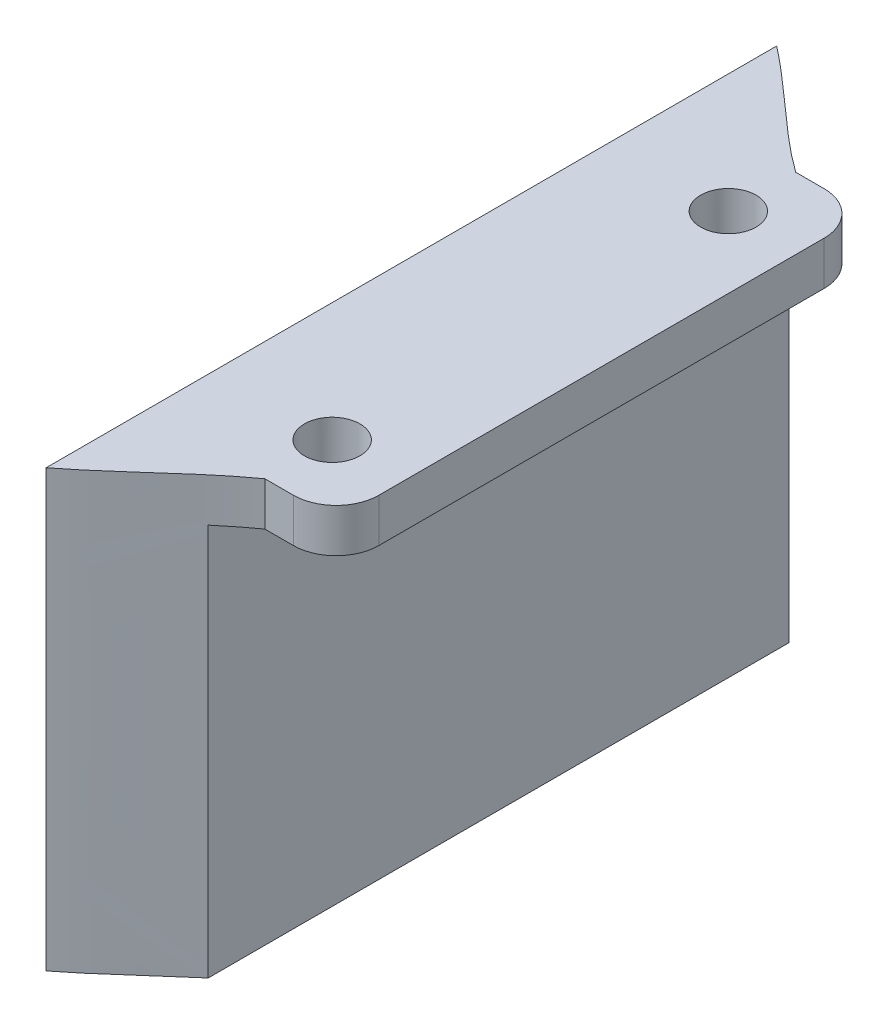
ISO-10303-21;
HEADER;
FILE_DESCRIPTION(('STEP AP214'),'2;1');
FILE_NAME('part.step','',(''),(''),'','','');
FILE_SCHEMA(('AUTOMOTIVE_DESIGN { 1 0 10303 214 1 1 1 1 }'));
ENDSEC;
DATA;
#1=APPLICATION_CONTEXT('core data for automotive mechanical design processes');
#2=APPLICATION_PROTOCOL_DEFINITION('international standard','automotive_design',2000,#1);
#3=PRODUCT_CONTEXT('',#1,'mechanical');
#4=PRODUCT('Part','Part','',(#3));
#5=PRODUCT_RELATED_PRODUCT_CATEGORY('part','',(#4));
#6=PRODUCT_DEFINITION_FORMATION('','',#4);
#7=PRODUCT_DEFINITION_CONTEXT('part definition',#1,'design');
#8=PRODUCT_DEFINITION('design','',#6,#7);
#9=PRODUCT_DEFINITION_SHAPE('','',#8);
#10=(LENGTH_UNIT() NAMED_UNIT(*) SI_UNIT(.MILLI.,.METRE.));
#11=(NAMED_UNIT(*) PLANE_ANGLE_UNIT() SI_UNIT($,.RADIAN.));
#12=(NAMED_UNIT(*) SI_UNIT($,.STERADIAN.) SOLID_ANGLE_UNIT());
#13=UNCERTAINTY_MEASURE_WITH_UNIT(LENGTH_MEASURE(1.E-05),#10,'distance_accuracy_value','');
#14=(GEOMETRIC_REPRESENTATION_CONTEXT(3) GLOBAL_UNCERTAINTY_ASSIGNED_CONTEXT((#13)) GLOBAL_UNIT_ASSIGNED_CONTEXT((#10,
#11,#12)) REPRESENTATION_CONTEXT('',''));
#15=CARTESIAN_POINT('',(0.,0.,0.));
#16=DIRECTION('',(0.,0.,1.));
#17=DIRECTION('',(1.,0.,0.));
#18=AXIS2_PLACEMENT_3D('',#15,#16,#17);
#19=CARTESIAN_POINT('',(138.702606635071,-5.5,42.5271998288506));
#20=DIRECTION('',(0.,1.,0.));
#21=DIRECTION('',(0.,0.,1.));
#22=AXIS2_PLACEMENT_3D('',#19,#20,#21);
#23=PLANE('',#22);
#24=CARTESIAN_POINT('',(142.702606635071,-5.5,-29.0568720379147));
#25=CARTESIAN_POINT('',(133.287763268237,-5.5,-35.7757587441815));
#26=CARTESIAN_POINT('',(125.082628435847,-5.5,-47.1414686898549));
#27=CARTESIAN_POINT('',(112.637979465165,-5.5,-48.4568720379147));
#28=B_SPLINE_CURVE_WITH_KNOTS('',3,(#24,#25,#26,#27),.UNSPECIFIED.,.F.,.F.,(4,4),(0.,1.),.UNSPECIFIED.);
#29=CARTESIAN_POINT('',(138.702606635071,-5.5,-32.1976654202298));
#30=VERTEX_POINT('',#29);
#31=CARTESIAN_POINT('',(142.702606635071,-5.5,-29.0568720379147));
#32=VERTEX_POINT('',#31);
#33=EDGE_CURVE('E526',#30,#32,#28,.F.);
#34=ORIENTED_EDGE('',*,*,#33,.T.);
#35=DIRECTION('',(1.,0.,0.));
#36=VECTOR('',#35,1.);
#37=CARTESIAN_POINT('',(146.202606635071,-5.5,-29.0568720379147));
#38=LINE('',#37,#36);
#39=CARTESIAN_POINT('',(146.302606635071,-5.5,-29.0568720379147));
#40=VERTEX_POINT('',#39);
#41=EDGE_CURVE('E521',#32,#40,#38,.T.);
#42=ORIENTED_EDGE('',*,*,#41,.T.);
#43=CARTESIAN_POINT('',(146.302606635071,-5.5,-23.6568720379147));
#44=DIRECTION('',(0.,1.,0.));
#45=DIRECTION('',(0.,0.,1.));
#46=AXIS2_PLACEMENT_3D('',#43,#44,#45);
#47=CIRCLE('',#46,5.40000000000002);
#48=CARTESIAN_POINT('',(151.702606635071,-5.5,-23.6568720379147));
#49=VERTEX_POINT('',#48);
#50=EDGE_CURVE('E525',#40,#49,#47,.F.);
#51=ORIENTED_EDGE('',*,*,#50,.T.);
#52=DIRECTION('',(0.,0.,1.));
#53=VECTOR('',#52,1.);
#54=CARTESIAN_POINT('',(151.702606635071,-5.5,42.5271998288506));
#55=LINE('',#54,#53);
#56=CARTESIAN_POINT('',(151.702606635071,-5.5,32.5431279620853));
#57=VERTEX_POINT('',#56);
#58=EDGE_CURVE('E580',#49,#57,#55,.T.);
#59=ORIENTED_EDGE('',*,*,#58,.T.);
#60=CARTESIAN_POINT('',(146.302606635071,-5.5,32.5431279620853));
#61=DIRECTION('',(0.,1.,0.));
#62=DIRECTION('',(0.,0.,1.));
#63=AXIS2_PLACEMENT_3D('',#60,#61,#62);
#64=CIRCLE('',#63,5.40000000000002);
#65=CARTESIAN_POINT('',(146.302606635071,-5.5,37.9431279620853));
#66=VERTEX_POINT('',#65);
#67=EDGE_CURVE('E564',#57,#66,#64,.F.);
#68=ORIENTED_EDGE('',*,*,#67,.T.);
#69=DIRECTION('',(-1.,0.,0.));
#70=VECTOR('',#69,1.);
#71=CARTESIAN_POINT('',(146.202606635071,-5.5,37.9431279620853));
#72=LINE('',#71,#70);
#73=CARTESIAN_POINT('',(142.702606635071,-5.5,37.9431279620853));
#74=VERTEX_POINT('',#73);
#75=EDGE_CURVE('E566',#66,#74,#72,.T.);
#76=ORIENTED_EDGE('',*,*,#75,.T.);
#77=CARTESIAN_POINT('',(112.637979465165,-5.5,57.3431279620853));
#78=CARTESIAN_POINT('',(125.082628435847,-5.5,56.0277246140255));
#79=CARTESIAN_POINT('',(133.287763268237,-5.5,44.6620146683521));
#80=CARTESIAN_POINT('',(142.702606635071,-5.5,37.9431279620853));
#81=B_SPLINE_CURVE_WITH_KNOTS('',3,(#77,#78,#79,#80),.UNSPECIFIED.,.F.,.F.,(4,4),(0.,1.),.UNSPECIFIED.);
#82=CARTESIAN_POINT('',(138.702606635071,-5.5,41.0839213444004));
#83=VERTEX_POINT('',#82);
#84=EDGE_CURVE('E568',#74,#83,#81,.F.);
#85=ORIENTED_EDGE('',*,*,#84,.T.);
#86=DIRECTION('',(0.,0.,1.));
#87=VECTOR('',#86,1.);
#88=CARTESIAN_POINT('',(138.702606635071,-5.5,42.5271998288506));
#89=LINE('',#88,#87);
#90=EDGE_CURVE('E582',#30,#83,#89,.T.);
#91=ORIENTED_EDGE('',*,*,#90,.F.);
#92=EDGE_LOOP('',(#34,#42,#51,#59,#68,#76,#85,#91));
#93=FACE_BOUND('',#92,.T.);
#94=CARTESIAN_POINT('',(142.702606635071,-5.5,-20.5568720379147));
#95=DIRECTION('',(0.,1.,0.));
#96=DIRECTION('',(0.,0.,1.));
#97=AXIS2_PLACEMENT_3D('',#94,#95,#96);
#98=CIRCLE('',#97,3.49999999999999);
#99=CARTESIAN_POINT('',(142.702606635071,-5.5,-17.0568720379147));
#100=VERTEX_POINT('',#99);
#101=EDGE_CURVE('E579',#100,#100,#98,.F.);
#102=ORIENTED_EDGE('',*,*,#101,.F.);
#103=EDGE_LOOP('',(#102));
#104=FACE_BOUND('',#103,.T.);
#105=CARTESIAN_POINT('',(142.702606635071,-5.5,29.4431279620853));
#106=DIRECTION('',(0.,1.,0.));
#107=DIRECTION('',(0.,0.,1.));
#108=AXIS2_PLACEMENT_3D('',#105,#106,#107);
#109=CIRCLE('',#108,3.49999999999999);
#110=CARTESIAN_POINT('',(142.702606635071,-5.5,32.9431279620853));
#111=VERTEX_POINT('',#110);
#112=EDGE_CURVE('E573',#111,#111,#109,.F.);
#113=ORIENTED_EDGE('',*,*,#112,.F.);
#114=EDGE_LOOP('',(#113));
#115=FACE_BOUND('',#114,.T.);
#116=ADVANCED_FACE('F35',(#93,#104,#115),#23,.F.);
#117=CARTESIAN_POINT('',(138.702606635071,0.,0.));
#118=DIRECTION('',(1.,0.,0.));
#119=DIRECTION('',(0.,0.,-1.));
#120=AXIS2_PLACEMENT_3D('',#117,#118,#119);
#121=PLANE('',#120);
#122=ORIENTED_EDGE('',*,*,#90,.T.);
#123=DIRECTION('',(0.,1.,0.));
#124=VECTOR('',#123,1.);
#125=CARTESIAN_POINT('',(138.702606635071,-55.,41.0839213444004));
#126=LINE('',#125,#124);
#127=CARTESIAN_POINT('',(138.702606635071,-55.,41.0839213444004));
#128=VERTEX_POINT('',#127);
#129=EDGE_CURVE('E180',#128,#83,#126,.T.);
#130=ORIENTED_EDGE('',*,*,#129,.F.);
#131=DIRECTION('',(0.,0.,1.));
#132=VECTOR('',#131,1.);
#133=CARTESIAN_POINT('',(138.702606635071,-55.,32.5431279620853));
#134=LINE('',#133,#132);
#135=CARTESIAN_POINT('',(138.702606635071,-55.,-32.1976654202332));
#136=VERTEX_POINT('',#135);
#137=EDGE_CURVE('E554',#136,#128,#134,.T.);
#138=ORIENTED_EDGE('',*,*,#137,.F.);
#139=DIRECTION('',(0.,1.,0.));
#140=VECTOR('',#139,1.);
#141=CARTESIAN_POINT('',(138.702606635071,-55.,-32.1976654202298));
#142=LINE('',#141,#140);
#143=EDGE_CURVE('E552',#30,#136,#142,.F.);
#144=ORIENTED_EDGE('',*,*,#143,.F.);
#145=EDGE_LOOP('',(#122,#130,#138,#144));
#146=FACE_BOUND('',#145,.T.);
#147=ADVANCED_FACE('F437',(#146),#121,.T.);
#148=CARTESIAN_POINT('',(-115.897393364929,-55.,32.5431279620853));
#149=DIRECTION('',(0.,-1.,0.));
#150=DIRECTION('',(0.,0.,-1.));
#151=AXIS2_PLACEMENT_3D('',#148,#149,#150);
#152=PLANE('',#151);
#153=CARTESIAN_POINT('',(112.637979465165,-55.,57.3431279620853));
#154=CARTESIAN_POINT('',(125.082628435847,-55.,56.0277246140255));
#155=CARTESIAN_POINT('',(133.287763268237,-55.,44.6620146683521));
#156=CARTESIAN_POINT('',(142.702606635071,-55.,37.9431279620853));
#157=B_SPLINE_CURVE_WITH_KNOTS('',3,(#153,#154,#155,#156),.UNSPECIFIED.,.F.,.F.,(4,4),(0.,1.),.UNSPECIFIED.);
#158=CARTESIAN_POINT('',(127.702606635071,-55.,50.5386095784652));
#159=VERTEX_POINT('',#158);
#160=EDGE_CURVE('E132',#159,#128,#157,.T.);
#161=ORIENTED_EDGE('',*,*,#160,.F.);
#162=DIRECTION('',(0.,0.,-1.));
#163=VECTOR('',#162,1.);
#164=CARTESIAN_POINT('',(127.702606635071,-55.,44.0854997038593));
#165=LINE('',#164,#163);
#166=CARTESIAN_POINT('',(127.702606635071,-55.,-41.6523536542947));
#167=VERTEX_POINT('',#166);
#168=EDGE_CURVE('E206',#159,#167,#165,.T.);
#169=ORIENTED_EDGE('',*,*,#168,.T.);
#170=CARTESIAN_POINT('',(142.702606635071,-55.,-29.0568720379147));
#171=CARTESIAN_POINT('',(133.287763268237,-55.,-35.7757587441815));
#172=CARTESIAN_POINT('',(125.082628435847,-55.,-47.1414686898549));
#173=CARTESIAN_POINT('',(112.637979465165,-55.,-48.4568720379147));
#174=B_SPLINE_CURVE_WITH_KNOTS('',3,(#170,#171,#172,#173),.UNSPECIFIED.,.F.,.F.,(4,4),(0.,1.),.UNSPECIFIED.);
#175=EDGE_CURVE('E127',#136,#167,#174,.T.);
#176=ORIENTED_EDGE('',*,*,#175,.F.);
#177=ORIENTED_EDGE('',*,*,#137,.T.);
#178=EDGE_LOOP('',(#161,#169,#176,#177));
#179=FACE_BOUND('',#178,.T.);
#180=ADVANCED_FACE('F143',(#179),#152,.T.);
#181=DIRECTION('',(0.,1.,0.));
#182=VECTOR('',#181,1.);
#183=SURFACE_OF_LINEAR_EXTRUSION('',#174,#182);
#184=ORIENTED_EDGE('',*,*,#175,.T.);
#185=DIRECTION('',(0.,1.,0.));
#186=VECTOR('',#185,1.);
#187=CARTESIAN_POINT('',(127.702606635071,-55.,-41.6523536542947));
#188=LINE('',#187,#186);
#189=CARTESIAN_POINT('',(127.702606630983,0.,-41.6523536574432));
#190=VERTEX_POINT('',#189);
#191=EDGE_CURVE('E181',#167,#190,#188,.T.);
#192=ORIENTED_EDGE('',*,*,#191,.T.);
#193=CARTESIAN_POINT('',(142.702606635071,0.,-29.0568720379147));
#194=CARTESIAN_POINT('',(133.287763268237,0.,-35.7757587441815));
#195=CARTESIAN_POINT('',(125.082628435847,0.,-47.1414686898549));
#196=CARTESIAN_POINT('',(112.637979465165,0.,-48.4568720379147));
#197=B_SPLINE_CURVE_WITH_KNOTS('',3,(#193,#194,#195,#196),.UNSPECIFIED.,.F.,.F.,(4,4),(0.,1.),.UNSPECIFIED.);
#198=CARTESIAN_POINT('',(142.702606635071,0.,-29.0568720379147));
#199=VERTEX_POINT('',#198);
#200=EDGE_CURVE('E161',#199,#190,#197,.T.);
#201=ORIENTED_EDGE('',*,*,#200,.F.);
#202=DIRECTION('',(0.,1.,0.));
#203=VECTOR('',#202,1.);
#204=CARTESIAN_POINT('',(142.702606635071,-55.,-29.0568720379147));
#205=LINE('',#204,#203);
#206=EDGE_CURVE('E187',#32,#199,#205,.T.);
#207=ORIENTED_EDGE('',*,*,#206,.F.);
#208=ORIENTED_EDGE('',*,*,#33,.F.);
#209=ORIENTED_EDGE('',*,*,#143,.T.);
#210=EDGE_LOOP('',(#184,#192,#201,#207,#208,#209));
#211=FACE_BOUND('',#210,.T.);
#212=ADVANCED_FACE('F138',(#211),#183,.T.);
#213=CARTESIAN_POINT('',(146.202606635071,-55.,-29.0568720379147));
#214=DIRECTION('',(0.,0.,-1.));
#215=DIRECTION('',(-1.,0.,0.));
#216=AXIS2_PLACEMENT_3D('',#213,#214,#215);
#217=PLANE('',#216);
#218=ORIENTED_EDGE('',*,*,#41,.F.);
#219=ORIENTED_EDGE('',*,*,#206,.T.);
#220=DIRECTION('',(-1.,0.,0.));
#221=VECTOR('',#220,1.);
#222=CARTESIAN_POINT('',(146.202606635071,0.,-29.0568720379147));
#223=LINE('',#222,#221);
#224=CARTESIAN_POINT('',(146.302606635071,0.,-29.0568720379147));
#225=VERTEX_POINT('',#224);
#226=EDGE_CURVE('E534',#225,#199,#223,.T.);
#227=ORIENTED_EDGE('',*,*,#226,.F.);
#228=DIRECTION('',(0.,1.,0.));
#229=VECTOR('',#228,1.);
#230=CARTESIAN_POINT('',(146.302606635071,-55.,-29.0568720379147));
#231=LINE('',#230,#229);
#232=EDGE_CURVE('E523',#40,#225,#231,.T.);
#233=ORIENTED_EDGE('',*,*,#232,.F.);
#234=EDGE_LOOP('',(#218,#219,#227,#233));
#235=FACE_BOUND('',#234,.T.);
#236=ADVANCED_FACE('F142',(#235),#217,.T.);
#237=CARTESIAN_POINT('',(146.302606635071,-55.,-23.6568720379147));
#238=DIRECTION('',(0.,1.,0.));
#239=DIRECTION('',(0.,0.,1.));
#240=AXIS2_PLACEMENT_3D('',#237,#238,#239);
#241=CYLINDRICAL_SURFACE('',#240,5.40000000000002);
#242=ORIENTED_EDGE('',*,*,#50,.F.);
#243=ORIENTED_EDGE('',*,*,#232,.T.);
#244=CARTESIAN_POINT('',(146.302606635071,0.,-23.6568720379147));
#245=DIRECTION('',(0.,1.,0.));
#246=DIRECTION('',(0.,0.,-1.));
#247=AXIS2_PLACEMENT_3D('',#244,#245,#246);
#248=CIRCLE('',#247,5.40000000000002);
#249=CARTESIAN_POINT('',(151.702606635071,0.,-23.6568720379147));
#250=VERTEX_POINT('',#249);
#251=EDGE_CURVE('E536',#250,#225,#248,.T.);
#252=ORIENTED_EDGE('',*,*,#251,.F.);
#253=DIRECTION('',(0.,1.,0.));
#254=VECTOR('',#253,1.);
#255=CARTESIAN_POINT('',(151.702606635071,-55.,-23.6568720379147));
#256=LINE('',#255,#254);
#257=EDGE_CURVE('E530',#49,#250,#256,.T.);
#258=ORIENTED_EDGE('',*,*,#257,.F.);
#259=EDGE_LOOP('',(#242,#243,#252,#258));
#260=FACE_BOUND('',#259,.T.);
#261=ADVANCED_FACE('F492',(#260),#241,.T.);
#262=CARTESIAN_POINT('',(151.702606635071,-55.,-23.6568720379147));
#263=DIRECTION('',(1.,0.,0.));
#264=DIRECTION('',(0.,0.,-1.));
#265=AXIS2_PLACEMENT_3D('',#262,#263,#264);
#266=PLANE('',#265);
#267=ORIENTED_EDGE('',*,*,#58,.F.);
#268=ORIENTED_EDGE('',*,*,#257,.T.);
#269=DIRECTION('',(0.,0.,-1.));
#270=VECTOR('',#269,1.);
#271=CARTESIAN_POINT('',(151.702606635071,0.,-23.6568720379147));
#272=LINE('',#271,#270);
#273=CARTESIAN_POINT('',(151.702606635071,0.,32.5431279620853));
#274=VERTEX_POINT('',#273);
#275=EDGE_CURVE('E539',#274,#250,#272,.T.);
#276=ORIENTED_EDGE('',*,*,#275,.F.);
#277=DIRECTION('',(0.,1.,0.));
#278=VECTOR('',#277,1.);
#279=CARTESIAN_POINT('',(151.702606635071,-55.,32.5431279620853));
#280=LINE('',#279,#278);
#281=EDGE_CURVE('E597',#57,#274,#280,.T.);
#282=ORIENTED_EDGE('',*,*,#281,.F.);
#283=EDGE_LOOP('',(#267,#268,#276,#282));
#284=FACE_BOUND('',#283,.T.);
#285=ADVANCED_FACE('F483',(#284),#266,.T.);
#286=CARTESIAN_POINT('',(146.302606635071,-55.,32.5431279620853));
#287=DIRECTION('',(0.,1.,0.));
#288=DIRECTION('',(0.,0.,1.));
#289=AXIS2_PLACEMENT_3D('',#286,#287,#288);
#290=CYLINDRICAL_SURFACE('',#289,5.40000000000002);
#291=ORIENTED_EDGE('',*,*,#67,.F.);
#292=ORIENTED_EDGE('',*,*,#281,.T.);
#293=CARTESIAN_POINT('',(146.302606635071,0.,32.5431279620853));
#294=DIRECTION('',(0.,1.,0.));
#295=DIRECTION('',(0.,0.,1.));
#296=AXIS2_PLACEMENT_3D('',#293,#294,#295);
#297=CIRCLE('',#296,5.40000000000002);
#298=CARTESIAN_POINT('',(146.302606635071,0.,37.9431279620853));
#299=VERTEX_POINT('',#298);
#300=EDGE_CURVE('E542',#299,#274,#297,.T.);
#301=ORIENTED_EDGE('',*,*,#300,.F.);
#302=DIRECTION('',(0.,1.,0.));
#303=VECTOR('',#302,1.);
#304=CARTESIAN_POINT('',(146.302606635071,-55.,37.9431279620853));
#305=LINE('',#304,#303);
#306=EDGE_CURVE('E595',#66,#299,#305,.T.);
#307=ORIENTED_EDGE('',*,*,#306,.F.);
#308=EDGE_LOOP('',(#291,#292,#301,#307));
#309=FACE_BOUND('',#308,.T.);
#310=ADVANCED_FACE('F474',(#309),#290,.T.);
#311=CARTESIAN_POINT('',(146.202606635071,-55.,37.9431279620853));
#312=DIRECTION('',(0.,0.,1.));
#313=DIRECTION('',(1.,0.,0.));
#314=AXIS2_PLACEMENT_3D('',#311,#312,#313);
#315=PLANE('',#314);
#316=ORIENTED_EDGE('',*,*,#75,.F.);
#317=ORIENTED_EDGE('',*,*,#306,.T.);
#318=DIRECTION('',(1.,0.,0.));
#319=VECTOR('',#318,1.);
#320=CARTESIAN_POINT('',(146.202606635071,0.,37.9431279620853));
#321=LINE('',#320,#319);
#322=CARTESIAN_POINT('',(142.702606635071,0.,37.9431279620853));
#323=VERTEX_POINT('',#322);
#324=EDGE_CURVE('E174',#323,#299,#321,.T.);
#325=ORIENTED_EDGE('',*,*,#324,.F.);
#326=DIRECTION('',(0.,1.,0.));
#327=VECTOR('',#326,1.);
#328=CARTESIAN_POINT('',(142.702606635071,-55.,37.9431279620853));
#329=LINE('',#328,#327);
#330=EDGE_CURVE('E133',#74,#323,#329,.T.);
#331=ORIENTED_EDGE('',*,*,#330,.F.);
#332=EDGE_LOOP('',(#316,#317,#325,#331));
#333=FACE_BOUND('',#332,.T.);
#334=ADVANCED_FACE('F153',(#333),#315,.T.);
#335=DIRECTION('',(0.,1.,0.));
#336=VECTOR('',#335,1.);
#337=SURFACE_OF_LINEAR_EXTRUSION('',#157,#336);
#338=CARTESIAN_POINT('',(112.637979465165,0.,57.3431279620853));
#339=CARTESIAN_POINT('',(125.082628435847,0.,56.0277246140255));
#340=CARTESIAN_POINT('',(133.287763268237,0.,44.6620146683521));
#341=CARTESIAN_POINT('',(142.702606635071,0.,37.9431279620853));
#342=B_SPLINE_CURVE_WITH_KNOTS('',3,(#338,#339,#340,#341),.UNSPECIFIED.,.F.,.F.,(4,4),(0.,1.),.UNSPECIFIED.);
#343=CARTESIAN_POINT('',(127.702606630983,0.,50.5386095816137));
#344=VERTEX_POINT('',#343);
#345=EDGE_CURVE('E165',#344,#323,#342,.T.);
#346=ORIENTED_EDGE('',*,*,#345,.F.);
#347=DIRECTION('',(0.,1.,0.));
#348=VECTOR('',#347,1.);
#349=CARTESIAN_POINT('',(127.702606635071,-55.,50.5386095784652));
#350=LINE('',#349,#348);
#351=EDGE_CURVE('E175',#344,#159,#350,.F.);
#352=ORIENTED_EDGE('',*,*,#351,.T.);
#353=ORIENTED_EDGE('',*,*,#160,.T.);
#354=ORIENTED_EDGE('',*,*,#129,.T.);
#355=ORIENTED_EDGE('',*,*,#84,.F.);
#356=ORIENTED_EDGE('',*,*,#330,.T.);
#357=EDGE_LOOP('',(#346,#352,#353,#354,#355,#356));
#358=FACE_BOUND('',#357,.T.);
#359=ADVANCED_FACE('F149',(#358),#337,.T.);
#360=CARTESIAN_POINT('',(142.702606635071,-55.,-20.5568720379147));
#361=DIRECTION('',(0.,1.,0.));
#362=DIRECTION('',(0.,0.,1.));
#363=AXIS2_PLACEMENT_3D('',#360,#361,#362);
#364=CYLINDRICAL_SURFACE('',#363,3.49999999999999);
#365=ORIENTED_EDGE('',*,*,#101,.T.);
#366=EDGE_LOOP('',(#365));
#367=FACE_BOUND('',#366,.T.);
#368=CARTESIAN_POINT('',(142.702606635071,0.,-20.5568720379147));
#369=DIRECTION('',(0.,1.,0.));
#370=DIRECTION('',(0.,0.,-1.));
#371=AXIS2_PLACEMENT_3D('',#368,#369,#370);
#372=CIRCLE('',#371,3.49999999999999);
#373=CARTESIAN_POINT('',(142.702606635071,0.,-24.0568720379147));
#374=VERTEX_POINT('',#373);
#375=EDGE_CURVE('E549',#374,#374,#372,.T.);
#376=ORIENTED_EDGE('',*,*,#375,.T.);
#377=EDGE_LOOP('',(#376));
#378=FACE_BOUND('',#377,.T.);
#379=ADVANCED_FACE('F152',(#367,#378),#364,.F.);
#380=CARTESIAN_POINT('',(142.702606635071,-55.,29.4431279620853));
#381=DIRECTION('',(0.,1.,0.));
#382=DIRECTION('',(0.,0.,1.));
#383=AXIS2_PLACEMENT_3D('',#380,#381,#382);
#384=CYLINDRICAL_SURFACE('',#383,3.49999999999999);
#385=ORIENTED_EDGE('',*,*,#112,.T.);
#386=EDGE_LOOP('',(#385));
#387=FACE_BOUND('',#386,.T.);
#388=CARTESIAN_POINT('',(142.702606635071,0.,29.4431279620853));
#389=DIRECTION('',(0.,1.,0.));
#390=DIRECTION('',(0.,0.,-1.));
#391=AXIS2_PLACEMENT_3D('',#388,#389,#390);
#392=CIRCLE('',#391,3.49999999999999);
#393=CARTESIAN_POINT('',(142.702606635071,0.,25.9431279620853));
#394=VERTEX_POINT('',#393);
#395=EDGE_CURVE('E173',#394,#394,#392,.T.);
#396=ORIENTED_EDGE('',*,*,#395,.T.);
#397=EDGE_LOOP('',(#396));
#398=FACE_BOUND('',#397,.T.);
#399=ADVANCED_FACE('F410',(#387,#398),#384,.F.);
#400=CARTESIAN_POINT('',(-115.897393364929,0.,32.5431279620853));
#401=DIRECTION('',(0.,-1.,0.));
#402=DIRECTION('',(0.,0.,-1.));
#403=AXIS2_PLACEMENT_3D('',#400,#401,#402);
#404=PLANE('',#403);
#405=ORIENTED_EDGE('',*,*,#395,.F.);
#406=EDGE_LOOP('',(#405));
#407=FACE_BOUND('',#406,.T.);
#408=ORIENTED_EDGE('',*,*,#375,.F.);
#409=EDGE_LOOP('',(#408));
#410=FACE_BOUND('',#409,.T.);
#411=DIRECTION('',(0.,0.,-1.));
#412=VECTOR('',#411,1.);
#413=CARTESIAN_POINT('',(127.702606635071,0.,44.0854997038593));
#414=LINE('',#413,#412);
#415=EDGE_CURVE('E208',#344,#190,#414,.T.);
#416=ORIENTED_EDGE('',*,*,#415,.F.);
#417=ORIENTED_EDGE('',*,*,#345,.T.);
#418=ORIENTED_EDGE('',*,*,#324,.T.);
#419=ORIENTED_EDGE('',*,*,#300,.T.);
#420=ORIENTED_EDGE('',*,*,#275,.T.);
#421=ORIENTED_EDGE('',*,*,#251,.T.);
#422=ORIENTED_EDGE('',*,*,#226,.T.);
#423=ORIENTED_EDGE('',*,*,#200,.T.);
#424=EDGE_LOOP('',(#416,#417,#418,#419,#420,#421,#422,#423));
#425=FACE_BOUND('',#424,.T.);
#426=ADVANCED_FACE('F37',(#407,#410,#425),#404,.F.);
#427=CARTESIAN_POINT('',(127.702606635071,-55.02,-41.6523536542946));
#428=DIRECTION('',(-1.,0.,0.));
#429=DIRECTION('',(0.,0.,1.));
#430=AXIS2_PLACEMENT_3D('',#427,#428,#429);
#431=PLANE('',#430);
#432=DIRECTION('',(0.,0.,1.));
#433=VECTOR('',#432,1.);
#434=CARTESIAN_POINT('',(127.702606635071,-53.,-35.1992417871813));
#435=LINE('',#434,#433);
#436=CARTESIAN_POINT('',(127.702606635071,-53.,-35.1992417871813));
#437=VERTEX_POINT('',#436);
#438=CARTESIAN_POINT('',(127.702606635083,-53.,44.0854997038494));
#439=VERTEX_POINT('',#438);
#440=EDGE_CURVE('E100',#437,#439,#435,.T.);
#441=ORIENTED_EDGE('',*,*,#440,.F.);
#442=DIRECTION('',(0.,-1.,0.));
#443=VECTOR('',#442,1.);
#444=CARTESIAN_POINT('',(127.702606635071,-45.,-35.1992417871813));
#445=LINE('',#444,#443);
#446=CARTESIAN_POINT('',(127.702606635071,-45.,-35.1992417871813));
#447=VERTEX_POINT('',#446);
#448=EDGE_CURVE('E92',#447,#437,#445,.T.);
#449=ORIENTED_EDGE('',*,*,#448,.F.);
#450=DIRECTION('',(0.,0.,-1.));
#451=VECTOR('',#450,1.);
#452=CARTESIAN_POINT('',(127.702606635071,-45.,-35.1992417871813));
#453=LINE('',#452,#451);
#454=CARTESIAN_POINT('',(127.702606635071,-45.,44.0854997038494));
#455=VERTEX_POINT('',#454);
#456=EDGE_CURVE('E98',#455,#447,#453,.T.);
#457=ORIENTED_EDGE('',*,*,#456,.F.);
#458=DIRECTION('',(0.,1.,0.));
#459=VECTOR('',#458,1.);
#460=CARTESIAN_POINT('',(127.702606635071,-53.,44.0854997038494));
#461=LINE('',#460,#459);
#462=EDGE_CURVE('E119',#439,#455,#461,.T.);
#463=ORIENTED_EDGE('',*,*,#462,.F.);
#464=EDGE_LOOP('',(#441,#449,#457,#463));
#465=FACE_BOUND('',#464,.T.);
#466=ORIENTED_EDGE('',*,*,#415,.T.);
#467=ORIENTED_EDGE('',*,*,#191,.F.);
#468=ORIENTED_EDGE('',*,*,#168,.F.);
#469=ORIENTED_EDGE('',*,*,#351,.F.);
#470=EDGE_LOOP('',(#466,#467,#468,#469));
#471=FACE_BOUND('',#470,.T.);
#472=DIRECTION('',(0.,-1.,0.));
#473=VECTOR('',#472,1.);
#474=CARTESIAN_POINT('',(127.702606635071,-17.,-35.1992417871813));
#475=LINE('',#474,#473);
#476=CARTESIAN_POINT('',(127.702606635071,-17.,-35.1992417871813));
#477=VERTEX_POINT('',#476);
#478=CARTESIAN_POINT('',(127.702606635071,-25.,-35.1992417871813));
#479=VERTEX_POINT('',#478);
#480=EDGE_CURVE('E11',#477,#479,#475,.T.);
#481=ORIENTED_EDGE('',*,*,#480,.F.);
#482=DIRECTION('',(0.,0.,-1.));
#483=VECTOR('',#482,1.);
#484=CARTESIAN_POINT('',(127.702606635071,-17.,-35.1992417871813));
#485=LINE('',#484,#483);
#486=CARTESIAN_POINT('',(127.702606635071,-17.,44.0854997038494));
#487=VERTEX_POINT('',#486);
#488=EDGE_CURVE('E275',#487,#477,#485,.T.);
#489=ORIENTED_EDGE('',*,*,#488,.F.);
#490=DIRECTION('',(0.,1.,0.));
#491=VECTOR('',#490,1.);
#492=CARTESIAN_POINT('',(127.702606635071,-17.,44.0854997038494));
#493=LINE('',#492,#491);
#494=CARTESIAN_POINT('',(127.702606635083,-25.,44.0854997038494));
#495=VERTEX_POINT('',#494);
#496=EDGE_CURVE('E39',#495,#487,#493,.T.);
#497=ORIENTED_EDGE('',*,*,#496,.F.);
#498=DIRECTION('',(0.,0.,1.));
#499=VECTOR('',#498,1.);
#500=CARTESIAN_POINT('',(127.702606635071,-25.,-35.1992417871813));
#501=LINE('',#500,#499);
#502=EDGE_CURVE('E45',#479,#495,#501,.T.);
#503=ORIENTED_EDGE('',*,*,#502,.F.);
#504=EDGE_LOOP('',(#481,#489,#497,#503));
#505=FACE_BOUND('',#504,.T.);
#506=ADVANCED_FACE('F94',(#465,#471,#505),#431,.T.);
#507=CARTESIAN_POINT('',(218.389934569314,-17.,44.0854997038494));
#508=DIRECTION('',(0.,0.,1.));
#509=DIRECTION('',(1.,0.,0.));
#510=AXIS2_PLACEMENT_3D('',#507,#508,#509);
#511=PLANE('',#510);
#512=DIRECTION('',(-1.,0.,0.));
#513=VECTOR('',#512,1.);
#514=CARTESIAN_POINT('',(218.389934569314,-25.,44.0854997038494));
#515=LINE('',#514,#513);
#516=CARTESIAN_POINT('',(132.702606635071,-25.,44.0854997038494));
#517=VERTEX_POINT('',#516);
#518=EDGE_CURVE('E272',#517,#495,#515,.T.);
#519=ORIENTED_EDGE('',*,*,#518,.T.);
#520=ORIENTED_EDGE('',*,*,#496,.T.);
#521=DIRECTION('',(-1.,0.,0.));
#522=VECTOR('',#521,1.);
#523=CARTESIAN_POINT('',(218.389934569314,-17.,44.0854997038494));
#524=LINE('',#523,#522);
#525=CARTESIAN_POINT('',(132.702606635071,-17.,44.0854997038494));
#526=VERTEX_POINT('',#525);
#527=EDGE_CURVE('E289',#526,#487,#524,.T.);
#528=ORIENTED_EDGE('',*,*,#527,.F.);
#529=DIRECTION('',(0.,1.,0.));
#530=VECTOR('',#529,1.);
#531=CARTESIAN_POINT('',(132.702606635071,-17.,44.0854997038494));
#532=LINE('',#531,#530);
#533=EDGE_CURVE('E288',#517,#526,#532,.T.);
#534=ORIENTED_EDGE('',*,*,#533,.F.);
#535=EDGE_LOOP('',(#519,#520,#528,#534));
#536=FACE_BOUND('',#535,.T.);
#537=ADVANCED_FACE('F148',(#536),#511,.F.);
#538=CARTESIAN_POINT('',(132.702606635071,0.,0.));
#539=DIRECTION('',(1.,0.,0.));
#540=DIRECTION('',(0.,0.,-1.));
#541=AXIS2_PLACEMENT_3D('',#538,#539,#540);
#542=PLANE('',#541);
#543=DIRECTION('',(0.,-1.,0.));
#544=VECTOR('',#543,1.);
#545=CARTESIAN_POINT('',(132.702606635071,-17.,-35.1992417871813));
#546=LINE('',#545,#544);
#547=CARTESIAN_POINT('',(132.702606635071,-17.,-35.1992417871813));
#548=VERTEX_POINT('',#547);
#549=CARTESIAN_POINT('',(132.702606635071,-25.,-35.1992417871813));
#550=VERTEX_POINT('',#549);
#551=EDGE_CURVE('E54',#548,#550,#546,.T.);
#552=ORIENTED_EDGE('',*,*,#551,.T.);
#553=DIRECTION('',(0.,0.,1.));
#554=VECTOR('',#553,1.);
#555=CARTESIAN_POINT('',(132.702606635071,-25.,-35.1992417871813));
#556=LINE('',#555,#554);
#557=EDGE_CURVE('E267',#550,#517,#556,.T.);
#558=ORIENTED_EDGE('',*,*,#557,.T.);
#559=ORIENTED_EDGE('',*,*,#533,.T.);
#560=DIRECTION('',(0.,0.,-1.));
#561=VECTOR('',#560,1.);
#562=CARTESIAN_POINT('',(132.702606635071,-17.,-35.1992417871813));
#563=LINE('',#562,#561);
#564=EDGE_CURVE('E279',#526,#548,#563,.T.);
#565=ORIENTED_EDGE('',*,*,#564,.T.);
#566=EDGE_LOOP('',(#552,#558,#559,#565));
#567=FACE_BOUND('',#566,.T.);
#568=ADVANCED_FACE('F278',(#567),#542,.F.);
#569=CARTESIAN_POINT('',(218.389934569314,-25.,-35.1992417871813));
#570=DIRECTION('',(0.,-1.,0.));
#571=DIRECTION('',(0.,0.,-1.));
#572=AXIS2_PLACEMENT_3D('',#569,#570,#571);
#573=PLANE('',#572);
#574=DIRECTION('',(-1.,0.,0.));
#575=VECTOR('',#574,1.);
#576=CARTESIAN_POINT('',(218.389934569314,-25.,-35.1992417871813));
#577=LINE('',#576,#575);
#578=EDGE_CURVE('E104',#550,#479,#577,.T.);
#579=ORIENTED_EDGE('',*,*,#578,.T.);
#580=ORIENTED_EDGE('',*,*,#502,.T.);
#581=ORIENTED_EDGE('',*,*,#518,.F.);
#582=ORIENTED_EDGE('',*,*,#557,.F.);
#583=EDGE_LOOP('',(#579,#580,#581,#582));
#584=FACE_BOUND('',#583,.T.);
#585=ADVANCED_FACE('F268',(#584),#573,.F.);
#586=CARTESIAN_POINT('',(218.389934569314,-17.,-35.1992417871813));
#587=DIRECTION('',(0.,1.,0.));
#588=DIRECTION('',(0.,0.,1.));
#589=AXIS2_PLACEMENT_3D('',#586,#587,#588);
#590=PLANE('',#589);
#591=ORIENTED_EDGE('',*,*,#527,.T.);
#592=ORIENTED_EDGE('',*,*,#488,.T.);
#593=DIRECTION('',(-1.,0.,0.));
#594=VECTOR('',#593,1.);
#595=CARTESIAN_POINT('',(218.389934569314,-17.,-35.1992417871813));
#596=LINE('',#595,#594);
#597=EDGE_CURVE('E280',#548,#477,#596,.T.);
#598=ORIENTED_EDGE('',*,*,#597,.F.);
#599=ORIENTED_EDGE('',*,*,#564,.F.);
#600=EDGE_LOOP('',(#591,#592,#598,#599));
#601=FACE_BOUND('',#600,.T.);
#602=ADVANCED_FACE('F322',(#601),#590,.F.);
#603=CARTESIAN_POINT('',(218.389934569314,-17.,-35.1992417871813));
#604=DIRECTION('',(0.,0.,-1.));
#605=DIRECTION('',(-1.,0.,0.));
#606=AXIS2_PLACEMENT_3D('',#603,#604,#605);
#607=PLANE('',#606);
#608=ORIENTED_EDGE('',*,*,#597,.T.);
#609=ORIENTED_EDGE('',*,*,#480,.T.);
#610=ORIENTED_EDGE('',*,*,#578,.F.);
#611=ORIENTED_EDGE('',*,*,#551,.F.);
#612=EDGE_LOOP('',(#608,#609,#610,#611));
#613=FACE_BOUND('',#612,.T.);
#614=ADVANCED_FACE('F282',(#613),#607,.F.);
#615=CARTESIAN_POINT('',(218.389934569314,-53.,44.0854997038494));
#616=DIRECTION('',(0.,0.,1.));
#617=DIRECTION('',(1.,0.,0.));
#618=AXIS2_PLACEMENT_3D('',#615,#616,#617);
#619=PLANE('',#618);
#620=DIRECTION('',(-1.,0.,0.));
#621=VECTOR('',#620,1.);
#622=CARTESIAN_POINT('',(218.389934569314,-53.,44.0854997038494));
#623=LINE('',#622,#621);
#624=CARTESIAN_POINT('',(132.702606635071,-53.,44.0854997038494));
#625=VERTEX_POINT('',#624);
#626=EDGE_CURVE('E123',#625,#439,#623,.T.);
#627=ORIENTED_EDGE('',*,*,#626,.T.);
#628=ORIENTED_EDGE('',*,*,#462,.T.);
#629=DIRECTION('',(-1.,0.,0.));
#630=VECTOR('',#629,1.);
#631=CARTESIAN_POINT('',(218.389934569314,-45.,44.0854997038494));
#632=LINE('',#631,#630);
#633=CARTESIAN_POINT('',(132.702606635071,-45.,44.0854997038494));
#634=VERTEX_POINT('',#633);
#635=EDGE_CURVE('E118',#634,#455,#632,.T.);
#636=ORIENTED_EDGE('',*,*,#635,.F.);
#637=DIRECTION('',(0.,1.,0.));
#638=VECTOR('',#637,1.);
#639=CARTESIAN_POINT('',(132.702606635071,-53.,44.0854997038494));
#640=LINE('',#639,#638);
#641=EDGE_CURVE('E302',#625,#634,#640,.T.);
#642=ORIENTED_EDGE('',*,*,#641,.F.);
#643=EDGE_LOOP('',(#627,#628,#636,#642));
#644=FACE_BOUND('',#643,.T.);
#645=ADVANCED_FACE('F314',(#644),#619,.F.);
#646=CARTESIAN_POINT('',(132.702606635071,0.,0.));
#647=DIRECTION('',(1.,0.,0.));
#648=DIRECTION('',(0.,0.,-1.));
#649=AXIS2_PLACEMENT_3D('',#646,#647,#648);
#650=PLANE('',#649);
#651=DIRECTION('',(0.,-1.,0.));
#652=VECTOR('',#651,1.);
#653=CARTESIAN_POINT('',(132.702606635071,-45.,-35.1992417871813));
#654=LINE('',#653,#652);
#655=CARTESIAN_POINT('',(132.702606635071,-45.,-35.1992417871813));
#656=VERTEX_POINT('',#655);
#657=CARTESIAN_POINT('',(132.702606635071,-53.,-35.1992417871813));
#658=VERTEX_POINT('',#657);
#659=EDGE_CURVE('E110',#656,#658,#654,.T.);
#660=ORIENTED_EDGE('',*,*,#659,.T.);
#661=DIRECTION('',(0.,0.,1.));
#662=VECTOR('',#661,1.);
#663=CARTESIAN_POINT('',(132.702606635071,-53.,-35.1992417871813));
#664=LINE('',#663,#662);
#665=EDGE_CURVE('E120',#658,#625,#664,.T.);
#666=ORIENTED_EDGE('',*,*,#665,.T.);
#667=ORIENTED_EDGE('',*,*,#641,.T.);
#668=DIRECTION('',(0.,0.,-1.));
#669=VECTOR('',#668,1.);
#670=CARTESIAN_POINT('',(132.702606635071,-45.,-35.1992417871813));
#671=LINE('',#670,#669);
#672=EDGE_CURVE('E113',#634,#656,#671,.T.);
#673=ORIENTED_EDGE('',*,*,#672,.T.);
#674=EDGE_LOOP('',(#660,#666,#667,#673));
#675=FACE_BOUND('',#674,.T.);
#676=ADVANCED_FACE('F308',(#675),#650,.F.);
#677=CARTESIAN_POINT('',(218.389934569314,-53.,-35.1992417871813));
#678=DIRECTION('',(0.,-1.,0.));
#679=DIRECTION('',(0.,0.,-1.));
#680=AXIS2_PLACEMENT_3D('',#677,#678,#679);
#681=PLANE('',#680);
#682=DIRECTION('',(-1.,0.,0.));
#683=VECTOR('',#682,1.);
#684=CARTESIAN_POINT('',(218.389934569314,-53.,-35.1992417871813));
#685=LINE('',#684,#683);
#686=EDGE_CURVE('E298',#658,#437,#685,.T.);
#687=ORIENTED_EDGE('',*,*,#686,.T.);
#688=ORIENTED_EDGE('',*,*,#440,.T.);
#689=ORIENTED_EDGE('',*,*,#626,.F.);
#690=ORIENTED_EDGE('',*,*,#665,.F.);
#691=EDGE_LOOP('',(#687,#688,#689,#690));
#692=FACE_BOUND('',#691,.T.);
#693=ADVANCED_FACE('F310',(#692),#681,.F.);
#694=CARTESIAN_POINT('',(218.389934569314,-45.,-35.1992417871813));
#695=DIRECTION('',(0.,1.,0.));
#696=DIRECTION('',(0.,0.,1.));
#697=AXIS2_PLACEMENT_3D('',#694,#695,#696);
#698=PLANE('',#697);
#699=ORIENTED_EDGE('',*,*,#635,.T.);
#700=ORIENTED_EDGE('',*,*,#456,.T.);
#701=DIRECTION('',(-1.,0.,0.));
#702=VECTOR('',#701,1.);
#703=CARTESIAN_POINT('',(218.389934569314,-45.,-35.1992417871813));
#704=LINE('',#703,#702);
#705=EDGE_CURVE('E107',#656,#447,#704,.T.);
#706=ORIENTED_EDGE('',*,*,#705,.F.);
#707=ORIENTED_EDGE('',*,*,#672,.F.);
#708=EDGE_LOOP('',(#699,#700,#706,#707));
#709=FACE_BOUND('',#708,.T.);
#710=ADVANCED_FACE('F116',(#709),#698,.F.);
#711=CARTESIAN_POINT('',(218.389934569314,-45.,-35.1992417871813));
#712=DIRECTION('',(0.,0.,-1.));
#713=DIRECTION('',(-1.,0.,0.));
#714=AXIS2_PLACEMENT_3D('',#711,#712,#713);
#715=PLANE('',#714);
#716=ORIENTED_EDGE('',*,*,#705,.T.);
#717=ORIENTED_EDGE('',*,*,#448,.T.);
#718=ORIENTED_EDGE('',*,*,#686,.F.);
#719=ORIENTED_EDGE('',*,*,#659,.F.);
#720=EDGE_LOOP('',(#716,#717,#718,#719));
#721=FACE_BOUND('',#720,.T.);
#722=ADVANCED_FACE('F108',(#721),#715,.F.);
#723=CLOSED_SHELL('',(#116,#147,#180,#212,#236,#261,#285,#310,#334,#359,#379,#399,#426,#506,
#537,#568,#585,#602,#614,#645,#676,#693,#710,#722));
#724=MANIFOLD_SOLID_BREP('B2',#723);
#725=ADVANCED_BREP_SHAPE_REPRESENTATION('',(#18,#724),#14);
#726=SHAPE_DEFINITION_REPRESENTATION(#9,#725);
ENDSEC;
END-ISO-10303-21;
